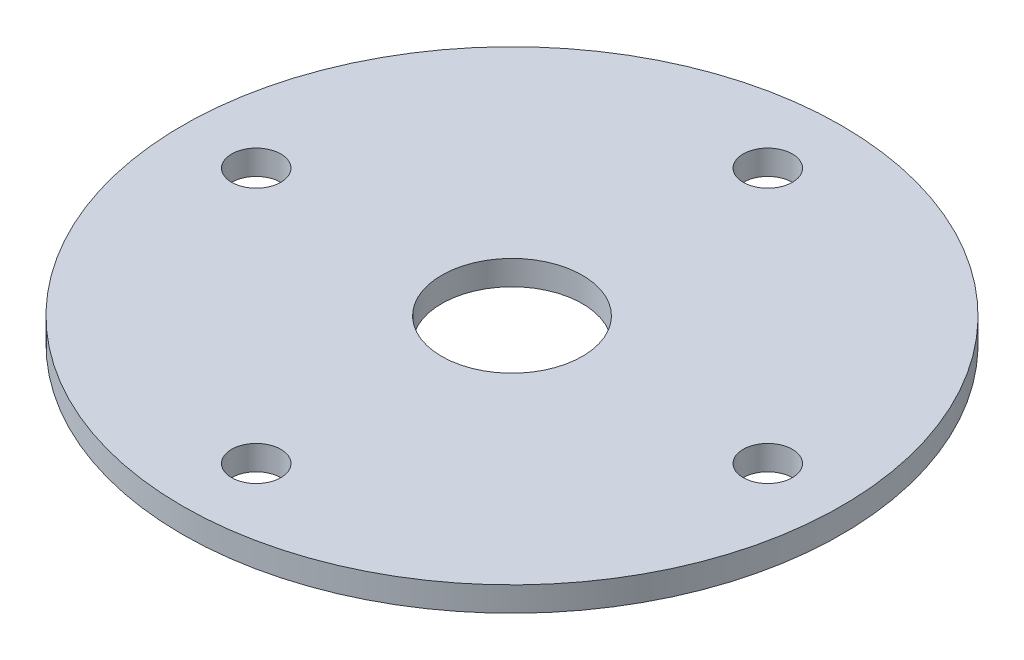
ISO-10303-21;
HEADER;
FILE_DESCRIPTION(('STEP AP214'),'2;1');
FILE_NAME('part.step','',(''),(''),'','','');
FILE_SCHEMA(('AUTOMOTIVE_DESIGN { 1 0 10303 214 1 1 1 1 }'));
ENDSEC;
DATA;
#1=APPLICATION_CONTEXT('core data for automotive mechanical design processes');
#2=APPLICATION_PROTOCOL_DEFINITION('international standard','automotive_design',2000,#1);
#3=PRODUCT_CONTEXT('',#1,'mechanical');
#4=PRODUCT('Part','Part','',(#3));
#5=PRODUCT_RELATED_PRODUCT_CATEGORY('part','',(#4));
#6=PRODUCT_DEFINITION_FORMATION('','',#4);
#7=PRODUCT_DEFINITION_CONTEXT('part definition',#1,'design');
#8=PRODUCT_DEFINITION('design','',#6,#7);
#9=PRODUCT_DEFINITION_SHAPE('','',#8);
#10=(LENGTH_UNIT() NAMED_UNIT(*) SI_UNIT(.MILLI.,.METRE.));
#11=(NAMED_UNIT(*) PLANE_ANGLE_UNIT() SI_UNIT($,.RADIAN.));
#12=(NAMED_UNIT(*) SI_UNIT($,.STERADIAN.) SOLID_ANGLE_UNIT());
#13=UNCERTAINTY_MEASURE_WITH_UNIT(LENGTH_MEASURE(1.E-05),#10,'distance_accuracy_value','');
#14=(GEOMETRIC_REPRESENTATION_CONTEXT(3) GLOBAL_UNCERTAINTY_ASSIGNED_CONTEXT((#13)) GLOBAL_UNIT_ASSIGNED_CONTEXT((#10,
#11,#12)) REPRESENTATION_CONTEXT('',''));
#15=CARTESIAN_POINT('',(0.,0.,0.));
#16=DIRECTION('',(0.,0.,1.));
#17=DIRECTION('',(1.,0.,0.));
#18=AXIS2_PLACEMENT_3D('',#15,#16,#17);
#19=CARTESIAN_POINT('',(52.,5.,0.));
#20=DIRECTION('',(0.,-1.,0.));
#21=DIRECTION('',(0.,0.,-1.));
#22=AXIS2_PLACEMENT_3D('',#19,#20,#21);
#23=CYLINDRICAL_SURFACE('',#22,5.);
#24=CARTESIAN_POINT('',(52.,5.,0.));
#25=DIRECTION('',(0.,1.,0.));
#26=DIRECTION('',(0.,0.,1.));
#27=AXIS2_PLACEMENT_3D('',#24,#25,#26);
#28=CIRCLE('',#27,5.);
#29=CARTESIAN_POINT('',(52.,5.,4.99999999999999));
#30=VERTEX_POINT('',#29);
#31=EDGE_CURVE('E52',#30,#30,#28,.T.);
#32=ORIENTED_EDGE('',*,*,#31,.T.);
#33=EDGE_LOOP('',(#32));
#34=FACE_BOUND('',#33,.T.);
#35=CARTESIAN_POINT('',(52.,0.,0.));
#36=DIRECTION('',(0.,1.,0.));
#37=DIRECTION('',(0.,0.,1.));
#38=AXIS2_PLACEMENT_3D('',#35,#36,#37);
#39=CIRCLE('',#38,5.);
#40=CARTESIAN_POINT('',(52.,0.,4.99999999999999));
#41=VERTEX_POINT('',#40);
#42=EDGE_CURVE('E74',#41,#41,#39,.T.);
#43=ORIENTED_EDGE('',*,*,#42,.F.);
#44=EDGE_LOOP('',(#43));
#45=FACE_BOUND('',#44,.T.);
#46=ADVANCED_FACE('F43',(#34,#45),#23,.F.);
#47=CARTESIAN_POINT('',(0.,5.,-52.));
#48=DIRECTION('',(0.,-1.,0.));
#49=DIRECTION('',(0.,0.,-1.));
#50=AXIS2_PLACEMENT_3D('',#47,#48,#49);
#51=CYLINDRICAL_SURFACE('',#50,5.);
#52=CARTESIAN_POINT('',(0.,5.,-52.));
#53=DIRECTION('',(0.,1.,0.));
#54=DIRECTION('',(0.,0.,1.));
#55=AXIS2_PLACEMENT_3D('',#52,#53,#54);
#56=CIRCLE('',#55,5.);
#57=CARTESIAN_POINT('',(0.,5.,-47.));
#58=VERTEX_POINT('',#57);
#59=EDGE_CURVE('E58',#58,#58,#56,.T.);
#60=ORIENTED_EDGE('',*,*,#59,.T.);
#61=EDGE_LOOP('',(#60));
#62=FACE_BOUND('',#61,.T.);
#63=CARTESIAN_POINT('',(0.,0.,-52.));
#64=DIRECTION('',(0.,1.,0.));
#65=DIRECTION('',(0.,0.,1.));
#66=AXIS2_PLACEMENT_3D('',#63,#64,#65);
#67=CIRCLE('',#66,5.);
#68=CARTESIAN_POINT('',(0.,0.,-47.));
#69=VERTEX_POINT('',#68);
#70=EDGE_CURVE('E71',#69,#69,#67,.T.);
#71=ORIENTED_EDGE('',*,*,#70,.F.);
#72=EDGE_LOOP('',(#71));
#73=FACE_BOUND('',#72,.T.);
#74=ADVANCED_FACE('F99',(#62,#73),#51,.F.);
#75=CARTESIAN_POINT('',(-52.,5.,0.));
#76=DIRECTION('',(0.,-1.,0.));
#77=DIRECTION('',(0.,0.,-1.));
#78=AXIS2_PLACEMENT_3D('',#75,#76,#77);
#79=CYLINDRICAL_SURFACE('',#78,5.);
#80=CARTESIAN_POINT('',(-52.,5.,0.));
#81=DIRECTION('',(0.,1.,0.));
#82=DIRECTION('',(0.,0.,1.));
#83=AXIS2_PLACEMENT_3D('',#80,#81,#82);
#84=CIRCLE('',#83,5.);
#85=CARTESIAN_POINT('',(-52.,5.,5.));
#86=VERTEX_POINT('',#85);
#87=EDGE_CURVE('E86',#86,#86,#84,.T.);
#88=ORIENTED_EDGE('',*,*,#87,.T.);
#89=EDGE_LOOP('',(#88));
#90=FACE_BOUND('',#89,.T.);
#91=CARTESIAN_POINT('',(-52.,0.,0.));
#92=DIRECTION('',(0.,1.,0.));
#93=DIRECTION('',(0.,0.,1.));
#94=AXIS2_PLACEMENT_3D('',#91,#92,#93);
#95=CIRCLE('',#94,5.);
#96=CARTESIAN_POINT('',(-52.,0.,5.));
#97=VERTEX_POINT('',#96);
#98=EDGE_CURVE('E66',#97,#97,#95,.T.);
#99=ORIENTED_EDGE('',*,*,#98,.F.);
#100=EDGE_LOOP('',(#99));
#101=FACE_BOUND('',#100,.T.);
#102=ADVANCED_FACE('F117',(#90,#101),#79,.F.);
#103=CARTESIAN_POINT('',(0.,5.,52.));
#104=DIRECTION('',(0.,-1.,0.));
#105=DIRECTION('',(0.,0.,-1.));
#106=AXIS2_PLACEMENT_3D('',#103,#104,#105);
#107=CYLINDRICAL_SURFACE('',#106,5.);
#108=CARTESIAN_POINT('',(0.,5.,52.));
#109=DIRECTION('',(0.,1.,0.));
#110=DIRECTION('',(0.,0.,1.));
#111=AXIS2_PLACEMENT_3D('',#108,#109,#110);
#112=CIRCLE('',#111,5.);
#113=CARTESIAN_POINT('',(0.,5.,57.));
#114=VERTEX_POINT('',#113);
#115=EDGE_CURVE('E81',#114,#114,#112,.T.);
#116=ORIENTED_EDGE('',*,*,#115,.T.);
#117=EDGE_LOOP('',(#116));
#118=FACE_BOUND('',#117,.T.);
#119=CARTESIAN_POINT('',(0.,0.,52.));
#120=DIRECTION('',(0.,1.,0.));
#121=DIRECTION('',(0.,0.,1.));
#122=AXIS2_PLACEMENT_3D('',#119,#120,#121);
#123=CIRCLE('',#122,5.);
#124=CARTESIAN_POINT('',(0.,0.,57.));
#125=VERTEX_POINT('',#124);
#126=EDGE_CURVE('E62',#125,#125,#123,.T.);
#127=ORIENTED_EDGE('',*,*,#126,.F.);
#128=EDGE_LOOP('',(#127));
#129=FACE_BOUND('',#128,.T.);
#130=ADVANCED_FACE('F45',(#118,#129),#107,.F.);
#131=CARTESIAN_POINT('',(0.,5.,0.));
#132=DIRECTION('',(0.,-1.,0.));
#133=DIRECTION('',(0.,0.,-1.));
#134=AXIS2_PLACEMENT_3D('',#131,#132,#133);
#135=CYLINDRICAL_SURFACE('',#134,67.);
#136=CARTESIAN_POINT('',(0.,5.,0.));
#137=DIRECTION('',(0.,1.,0.));
#138=DIRECTION('',(0.,0.,1.));
#139=AXIS2_PLACEMENT_3D('',#136,#137,#138);
#140=CIRCLE('',#139,67.);
#141=CARTESIAN_POINT('',(0.,5.,67.));
#142=VERTEX_POINT('',#141);
#143=EDGE_CURVE('E10',#142,#142,#140,.T.);
#144=ORIENTED_EDGE('',*,*,#143,.F.);
#145=EDGE_LOOP('',(#144));
#146=FACE_BOUND('',#145,.T.);
#147=CARTESIAN_POINT('',(0.,0.,0.));
#148=DIRECTION('',(0.,1.,0.));
#149=DIRECTION('',(0.,0.,1.));
#150=AXIS2_PLACEMENT_3D('',#147,#148,#149);
#151=CIRCLE('',#150,67.);
#152=CARTESIAN_POINT('',(0.,0.,67.));
#153=VERTEX_POINT('',#152);
#154=EDGE_CURVE('E47',#153,#153,#151,.T.);
#155=ORIENTED_EDGE('',*,*,#154,.T.);
#156=EDGE_LOOP('',(#155));
#157=FACE_BOUND('',#156,.T.);
#158=ADVANCED_FACE('F106',(#146,#157),#135,.T.);
#159=CARTESIAN_POINT('',(0.,5.,0.));
#160=DIRECTION('',(0.,1.,0.));
#161=DIRECTION('',(0.,0.,1.));
#162=AXIS2_PLACEMENT_3D('',#159,#160,#161);
#163=PLANE('',#162);
#164=CARTESIAN_POINT('',(0.,5.,0.));
#165=DIRECTION('',(0.,1.,0.));
#166=DIRECTION('',(0.,0.,1.));
#167=AXIS2_PLACEMENT_3D('',#164,#165,#166);
#168=CIRCLE('',#167,14.3);
#169=CARTESIAN_POINT('',(0.,5.,14.3));
#170=VERTEX_POINT('',#169);
#171=EDGE_CURVE('E67',#170,#170,#168,.T.);
#172=ORIENTED_EDGE('',*,*,#171,.F.);
#173=EDGE_LOOP('',(#172));
#174=FACE_BOUND('',#173,.T.);
#175=ORIENTED_EDGE('',*,*,#115,.F.);
#176=EDGE_LOOP('',(#175));
#177=FACE_BOUND('',#176,.T.);
#178=ORIENTED_EDGE('',*,*,#87,.F.);
#179=EDGE_LOOP('',(#178));
#180=FACE_BOUND('',#179,.T.);
#181=ORIENTED_EDGE('',*,*,#59,.F.);
#182=EDGE_LOOP('',(#181));
#183=FACE_BOUND('',#182,.T.);
#184=ORIENTED_EDGE('',*,*,#31,.F.);
#185=EDGE_LOOP('',(#184));
#186=FACE_BOUND('',#185,.T.);
#187=ORIENTED_EDGE('',*,*,#143,.T.);
#188=EDGE_LOOP('',(#187));
#189=FACE_BOUND('',#188,.T.);
#190=ADVANCED_FACE('F102',(#174,#177,#180,#183,#186,#189),#163,.T.);
#191=CARTESIAN_POINT('',(0.,0.,0.));
#192=DIRECTION('',(0.,1.,0.));
#193=DIRECTION('',(0.,0.,1.));
#194=AXIS2_PLACEMENT_3D('',#191,#192,#193);
#195=PLANE('',#194);
#196=CARTESIAN_POINT('',(0.,0.,0.));
#197=DIRECTION('',(0.,1.,0.));
#198=DIRECTION('',(0.,0.,1.));
#199=AXIS2_PLACEMENT_3D('',#196,#197,#198);
#200=CIRCLE('',#199,14.3);
#201=CARTESIAN_POINT('',(0.,0.,14.3));
#202=VERTEX_POINT('',#201);
#203=EDGE_CURVE('E144',#202,#202,#200,.T.);
#204=ORIENTED_EDGE('',*,*,#203,.T.);
#205=EDGE_LOOP('',(#204));
#206=FACE_BOUND('',#205,.T.);
#207=ORIENTED_EDGE('',*,*,#126,.T.);
#208=EDGE_LOOP('',(#207));
#209=FACE_BOUND('',#208,.T.);
#210=ORIENTED_EDGE('',*,*,#98,.T.);
#211=EDGE_LOOP('',(#210));
#212=FACE_BOUND('',#211,.T.);
#213=ORIENTED_EDGE('',*,*,#70,.T.);
#214=EDGE_LOOP('',(#213));
#215=FACE_BOUND('',#214,.T.);
#216=ORIENTED_EDGE('',*,*,#42,.T.);
#217=EDGE_LOOP('',(#216));
#218=FACE_BOUND('',#217,.T.);
#219=ORIENTED_EDGE('',*,*,#154,.F.);
#220=EDGE_LOOP('',(#219));
#221=FACE_BOUND('',#220,.T.);
#222=ADVANCED_FACE('F105',(#206,#209,#212,#215,#218,#221),#195,.F.);
#223=CARTESIAN_POINT('',(0.,0.,0.));
#224=DIRECTION('',(0.,1.,0.));
#225=DIRECTION('',(0.,0.,1.));
#226=AXIS2_PLACEMENT_3D('',#223,#224,#225);
#227=CYLINDRICAL_SURFACE('',#226,14.3);
#228=ORIENTED_EDGE('',*,*,#171,.T.);
#229=EDGE_LOOP('',(#228));
#230=FACE_BOUND('',#229,.T.);
#231=ORIENTED_EDGE('',*,*,#203,.F.);
#232=EDGE_LOOP('',(#231));
#233=FACE_BOUND('',#232,.T.);
#234=ADVANCED_FACE('F132',(#230,#233),#227,.F.);
#235=CLOSED_SHELL('',(#46,#74,#102,#130,#158,#190,#222,#234));
#236=MANIFOLD_SOLID_BREP('B2',#235);
#237=ADVANCED_BREP_SHAPE_REPRESENTATION('',(#18,#236),#14);
#238=SHAPE_DEFINITION_REPRESENTATION(#9,#237);
ENDSEC;
END-ISO-10303-21;
